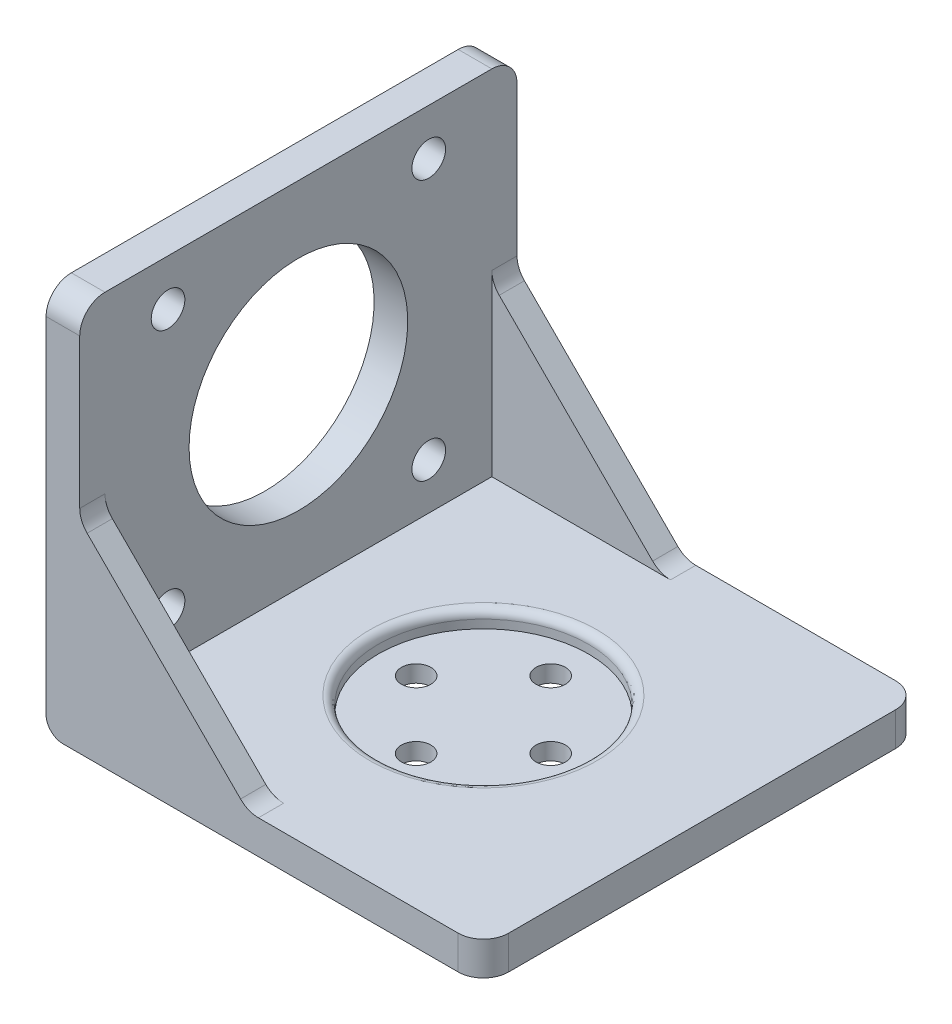
ISO-10303-21;
HEADER;
FILE_DESCRIPTION(('STEP AP214'),'2;1');
FILE_NAME('part.step','',(''),(''),'','','');
FILE_SCHEMA(('AUTOMOTIVE_DESIGN { 1 0 10303 214 1 1 1 1 }'));
ENDSEC;
DATA;
#1=APPLICATION_CONTEXT('core data for automotive mechanical design processes');
#2=APPLICATION_PROTOCOL_DEFINITION('international standard','automotive_design',2000,#1);
#3=PRODUCT_CONTEXT('',#1,'mechanical');
#4=PRODUCT('Part','Part','',(#3));
#5=PRODUCT_RELATED_PRODUCT_CATEGORY('part','',(#4));
#6=PRODUCT_DEFINITION_FORMATION('','',#4);
#7=PRODUCT_DEFINITION_CONTEXT('part definition',#1,'design');
#8=PRODUCT_DEFINITION('design','',#6,#7);
#9=PRODUCT_DEFINITION_SHAPE('','',#8);
#10=(LENGTH_UNIT() NAMED_UNIT(*) SI_UNIT(.MILLI.,.METRE.));
#11=(NAMED_UNIT(*) PLANE_ANGLE_UNIT() SI_UNIT($,.RADIAN.));
#12=(NAMED_UNIT(*) SI_UNIT($,.STERADIAN.) SOLID_ANGLE_UNIT());
#13=UNCERTAINTY_MEASURE_WITH_UNIT(LENGTH_MEASURE(1.E-05),#10,'distance_accuracy_value','');
#14=(GEOMETRIC_REPRESENTATION_CONTEXT(3) GLOBAL_UNCERTAINTY_ASSIGNED_CONTEXT((#13)) GLOBAL_UNIT_ASSIGNED_CONTEXT((#10,
#11,#12)) REPRESENTATION_CONTEXT('',''));
#15=CARTESIAN_POINT('',(0.,0.,0.));
#16=DIRECTION('',(0.,0.,1.));
#17=DIRECTION('',(1.,0.,0.));
#18=AXIS2_PLACEMENT_3D('',#15,#16,#17);
#19=CARTESIAN_POINT('',(8.,4.,0.));
#20=DIRECTION('',(0.,-1.,0.));
#21=DIRECTION('',(0.,0.,-1.));
#22=AXIS2_PLACEMENT_3D('',#19,#20,#21);
#23=CYLINDRICAL_SURFACE('',#22,1.75);
#24=CARTESIAN_POINT('',(8.,0.,0.));
#25=DIRECTION('',(0.,1.,0.));
#26=DIRECTION('',(0.,0.,1.));
#27=AXIS2_PLACEMENT_3D('',#24,#25,#26);
#28=CIRCLE('',#27,1.75);
#29=CARTESIAN_POINT('',(8.,0.,1.75));
#30=VERTEX_POINT('',#29);
#31=EDGE_CURVE('E212',#30,#30,#28,.T.);
#32=ORIENTED_EDGE('',*,*,#31,.F.);
#33=EDGE_LOOP('',(#32));
#34=FACE_BOUND('',#33,.T.);
#35=CARTESIAN_POINT('',(8.,2.,0.));
#36=DIRECTION('',(0.,1.,0.));
#37=DIRECTION('',(0.,0.,1.));
#38=AXIS2_PLACEMENT_3D('',#35,#36,#37);
#39=CIRCLE('',#38,1.75);
#40=CARTESIAN_POINT('',(8.,2.,1.75));
#41=VERTEX_POINT('',#40);
#42=EDGE_CURVE('E344',#41,#41,#39,.T.);
#43=ORIENTED_EDGE('',*,*,#42,.T.);
#44=EDGE_LOOP('',(#43));
#45=FACE_BOUND('',#44,.T.);
#46=ADVANCED_FACE('F39',(#34,#45),#23,.F.);
#47=CARTESIAN_POINT('',(0.,4.,-8.));
#48=DIRECTION('',(0.,-1.,0.));
#49=DIRECTION('',(0.,0.,-1.));
#50=AXIS2_PLACEMENT_3D('',#47,#48,#49);
#51=CYLINDRICAL_SURFACE('',#50,1.75);
#52=CARTESIAN_POINT('',(0.,0.,-8.));
#53=DIRECTION('',(0.,1.,0.));
#54=DIRECTION('',(0.,0.,1.));
#55=AXIS2_PLACEMENT_3D('',#52,#53,#54);
#56=CIRCLE('',#55,1.75);
#57=CARTESIAN_POINT('',(0.,0.,-6.25));
#58=VERTEX_POINT('',#57);
#59=EDGE_CURVE('E209',#58,#58,#56,.T.);
#60=ORIENTED_EDGE('',*,*,#59,.F.);
#61=EDGE_LOOP('',(#60));
#62=FACE_BOUND('',#61,.T.);
#63=CARTESIAN_POINT('',(0.,2.,-8.));
#64=DIRECTION('',(0.,1.,0.));
#65=DIRECTION('',(0.,0.,1.));
#66=AXIS2_PLACEMENT_3D('',#63,#64,#65);
#67=CIRCLE('',#66,1.75);
#68=CARTESIAN_POINT('',(0.,2.,-6.25));
#69=VERTEX_POINT('',#68);
#70=EDGE_CURVE('E341',#69,#69,#67,.T.);
#71=ORIENTED_EDGE('',*,*,#70,.T.);
#72=EDGE_LOOP('',(#71));
#73=FACE_BOUND('',#72,.T.);
#74=ADVANCED_FACE('F455',(#62,#73),#51,.F.);
#75=CARTESIAN_POINT('',(-8.,4.,0.));
#76=DIRECTION('',(0.,-1.,0.));
#77=DIRECTION('',(0.,0.,-1.));
#78=AXIS2_PLACEMENT_3D('',#75,#76,#77);
#79=CYLINDRICAL_SURFACE('',#78,1.75);
#80=CARTESIAN_POINT('',(-8.,0.,0.));
#81=DIRECTION('',(0.,1.,0.));
#82=DIRECTION('',(0.,0.,1.));
#83=AXIS2_PLACEMENT_3D('',#80,#81,#82);
#84=CIRCLE('',#83,1.75);
#85=CARTESIAN_POINT('',(-8.,0.,1.75));
#86=VERTEX_POINT('',#85);
#87=EDGE_CURVE('E199',#86,#86,#84,.T.);
#88=ORIENTED_EDGE('',*,*,#87,.F.);
#89=EDGE_LOOP('',(#88));
#90=FACE_BOUND('',#89,.T.);
#91=CARTESIAN_POINT('',(-8.,2.,0.));
#92=DIRECTION('',(0.,1.,0.));
#93=DIRECTION('',(0.,0.,1.));
#94=AXIS2_PLACEMENT_3D('',#91,#92,#93);
#95=CIRCLE('',#94,1.75);
#96=CARTESIAN_POINT('',(-8.,2.,1.75));
#97=VERTEX_POINT('',#96);
#98=EDGE_CURVE('E225',#97,#97,#95,.T.);
#99=ORIENTED_EDGE('',*,*,#98,.T.);
#100=EDGE_LOOP('',(#99));
#101=FACE_BOUND('',#100,.T.);
#102=ADVANCED_FACE('F461',(#90,#101),#79,.F.);
#103=CARTESIAN_POINT('',(0.,4.,8.));
#104=DIRECTION('',(0.,-1.,0.));
#105=DIRECTION('',(0.,0.,-1.));
#106=AXIS2_PLACEMENT_3D('',#103,#104,#105);
#107=CYLINDRICAL_SURFACE('',#106,1.75);
#108=CARTESIAN_POINT('',(0.,0.,8.));
#109=DIRECTION('',(0.,1.,0.));
#110=DIRECTION('',(0.,0.,1.));
#111=AXIS2_PLACEMENT_3D('',#108,#109,#110);
#112=CIRCLE('',#111,1.75);
#113=CARTESIAN_POINT('',(0.,0.,9.75));
#114=VERTEX_POINT('',#113);
#115=EDGE_CURVE('E196',#114,#114,#112,.T.);
#116=ORIENTED_EDGE('',*,*,#115,.F.);
#117=EDGE_LOOP('',(#116));
#118=FACE_BOUND('',#117,.T.);
#119=CARTESIAN_POINT('',(0.,2.,8.));
#120=DIRECTION('',(0.,1.,0.));
#121=DIRECTION('',(0.,0.,1.));
#122=AXIS2_PLACEMENT_3D('',#119,#120,#121);
#123=CIRCLE('',#122,1.75);
#124=CARTESIAN_POINT('',(0.,2.,9.75));
#125=VERTEX_POINT('',#124);
#126=EDGE_CURVE('E222',#125,#125,#123,.T.);
#127=ORIENTED_EDGE('',*,*,#126,.T.);
#128=EDGE_LOOP('',(#127));
#129=FACE_BOUND('',#128,.T.);
#130=ADVANCED_FACE('F471',(#118,#129),#107,.F.);
#131=CARTESIAN_POINT('',(0.,4.,0.));
#132=DIRECTION('',(0.,-1.,0.));
#133=DIRECTION('',(0.,0.,-1.));
#134=AXIS2_PLACEMENT_3D('',#131,#132,#133);
#135=PLANE('',#134);
#136=CARTESIAN_POINT('',(0.,4.,0.));
#137=DIRECTION('',(0.,-1.,0.));
#138=DIRECTION('',(0.,0.,-1.));
#139=AXIS2_PLACEMENT_3D('',#136,#137,#138);
#140=CIRCLE('',#139,13.5);
#141=CARTESIAN_POINT('',(0.,4.,-13.5));
#142=VERTEX_POINT('',#141);
#143=EDGE_CURVE('E302',#142,#142,#140,.T.);
#144=ORIENTED_EDGE('',*,*,#143,.T.);
#145=EDGE_LOOP('',(#144));
#146=FACE_BOUND('',#145,.T.);
#147=DIRECTION('',(1.,0.,0.));
#148=VECTOR('',#147,1.);
#149=CARTESIAN_POINT('',(26.,4.,-26.));
#150=LINE('',#149,#148);
#151=CARTESIAN_POINT('',(-0.75735931288072,4.,-26.));
#152=VERTEX_POINT('',#151);
#153=CARTESIAN_POINT('',(23.,4.,-26.));
#154=VERTEX_POINT('',#153);
#155=EDGE_CURVE('E421',#152,#154,#150,.T.);
#156=ORIENTED_EDGE('',*,*,#155,.F.);
#157=DIRECTION('',(0.,0.,1.));
#158=VECTOR('',#157,1.);
#159=CARTESIAN_POINT('',(-0.75735931288072,4.,-23.));
#160=LINE('',#159,#158);
#161=CARTESIAN_POINT('',(-0.757359312880727,4.,-23.));
#162=VERTEX_POINT('',#161);
#163=EDGE_CURVE('E189',#152,#162,#160,.T.);
#164=ORIENTED_EDGE('',*,*,#163,.T.);
#165=DIRECTION('',(-1.,0.,0.));
#166=VECTOR('',#165,1.);
#167=CARTESIAN_POINT('',(-26.,4.,-23.));
#168=LINE('',#167,#166);
#169=CARTESIAN_POINT('',(-22.,4.,-23.));
#170=VERTEX_POINT('',#169);
#171=EDGE_CURVE('E173',#162,#170,#168,.T.);
#172=ORIENTED_EDGE('',*,*,#171,.T.);
#173=DIRECTION('',(0.,0.,1.));
#174=VECTOR('',#173,1.);
#175=CARTESIAN_POINT('',(-22.,4.,23.));
#176=LINE('',#175,#174);
#177=CARTESIAN_POINT('',(-22.,4.,23.));
#178=VERTEX_POINT('',#177);
#179=EDGE_CURVE('E179',#170,#178,#176,.T.);
#180=ORIENTED_EDGE('',*,*,#179,.T.);
#181=DIRECTION('',(1.,0.,0.));
#182=VECTOR('',#181,1.);
#183=CARTESIAN_POINT('',(-26.,4.,23.));
#184=LINE('',#183,#182);
#185=CARTESIAN_POINT('',(-0.75735931288072,4.,23.));
#186=VERTEX_POINT('',#185);
#187=EDGE_CURVE('E190',#178,#186,#184,.T.);
#188=ORIENTED_EDGE('',*,*,#187,.T.);
#189=DIRECTION('',(0.,0.,-1.));
#190=VECTOR('',#189,1.);
#191=CARTESIAN_POINT('',(-0.75735931288072,4.,0.));
#192=LINE('',#191,#190);
#193=CARTESIAN_POINT('',(-0.75735931288072,4.,26.));
#194=VERTEX_POINT('',#193);
#195=EDGE_CURVE('E277',#186,#194,#192,.F.);
#196=ORIENTED_EDGE('',*,*,#195,.T.);
#197=DIRECTION('',(1.,0.,0.));
#198=VECTOR('',#197,1.);
#199=CARTESIAN_POINT('',(-2.00000000000001,4.,26.));
#200=LINE('',#199,#198);
#201=CARTESIAN_POINT('',(23.,4.,26.));
#202=VERTEX_POINT('',#201);
#203=EDGE_CURVE('E333',#194,#202,#200,.T.);
#204=ORIENTED_EDGE('',*,*,#203,.T.);
#205=CARTESIAN_POINT('',(23.,4.,23.));
#206=DIRECTION('',(0.,-1.,0.));
#207=DIRECTION('',(0.,0.,-1.));
#208=AXIS2_PLACEMENT_3D('',#205,#206,#207);
#209=CIRCLE('',#208,3.);
#210=CARTESIAN_POINT('',(26.,4.,23.));
#211=VERTEX_POINT('',#210);
#212=EDGE_CURVE('E254',#202,#211,#209,.F.);
#213=ORIENTED_EDGE('',*,*,#212,.T.);
#214=DIRECTION('',(0.,0.,-1.));
#215=VECTOR('',#214,1.);
#216=CARTESIAN_POINT('',(26.,4.,23.));
#217=LINE('',#216,#215);
#218=CARTESIAN_POINT('',(26.,4.,-23.));
#219=VERTEX_POINT('',#218);
#220=EDGE_CURVE('E191',#211,#219,#217,.T.);
#221=ORIENTED_EDGE('',*,*,#220,.T.);
#222=CARTESIAN_POINT('',(23.,4.,-23.));
#223=DIRECTION('',(0.,-1.,0.));
#224=DIRECTION('',(0.,0.,-1.));
#225=AXIS2_PLACEMENT_3D('',#222,#223,#224);
#226=CIRCLE('',#225,3.);
#227=EDGE_CURVE('E263',#219,#154,#226,.F.);
#228=ORIENTED_EDGE('',*,*,#227,.T.);
#229=EDGE_LOOP('',(#156,#164,#172,#180,#188,#196,#204,#213,#221,#228));
#230=FACE_BOUND('',#229,.T.);
#231=ADVANCED_FACE('F186',(#146,#230),#135,.F.);
#232=CARTESIAN_POINT('',(0.,0.,0.));
#233=DIRECTION('',(0.,-1.,0.));
#234=DIRECTION('',(0.,0.,-1.));
#235=AXIS2_PLACEMENT_3D('',#232,#233,#234);
#236=PLANE('',#235);
#237=ORIENTED_EDGE('',*,*,#87,.T.);
#238=EDGE_LOOP('',(#237));
#239=FACE_BOUND('',#238,.T.);
#240=ORIENTED_EDGE('',*,*,#31,.T.);
#241=EDGE_LOOP('',(#240));
#242=FACE_BOUND('',#241,.T.);
#243=DIRECTION('',(-1.,0.,0.));
#244=VECTOR('',#243,1.);
#245=CARTESIAN_POINT('',(26.,0.,26.));
#246=LINE('',#245,#244);
#247=CARTESIAN_POINT('',(23.,0.,26.));
#248=VERTEX_POINT('',#247);
#249=CARTESIAN_POINT('',(-24.,0.,26.));
#250=VERTEX_POINT('',#249);
#251=EDGE_CURVE('E322',#248,#250,#246,.T.);
#252=ORIENTED_EDGE('',*,*,#251,.T.);
#253=DIRECTION('',(0.,0.,1.));
#254=VECTOR('',#253,1.);
#255=CARTESIAN_POINT('',(-24.,0.,-26.));
#256=LINE('',#255,#254);
#257=CARTESIAN_POINT('',(-24.,0.,-26.));
#258=VERTEX_POINT('',#257);
#259=EDGE_CURVE('E47',#250,#258,#256,.F.);
#260=ORIENTED_EDGE('',*,*,#259,.T.);
#261=DIRECTION('',(-1.,0.,0.));
#262=VECTOR('',#261,1.);
#263=CARTESIAN_POINT('',(-26.,0.,-26.));
#264=LINE('',#263,#262);
#265=CARTESIAN_POINT('',(23.,0.,-26.));
#266=VERTEX_POINT('',#265);
#267=EDGE_CURVE('E423',#266,#258,#264,.T.);
#268=ORIENTED_EDGE('',*,*,#267,.F.);
#269=CARTESIAN_POINT('',(23.,0.,-23.));
#270=DIRECTION('',(0.,-1.,0.));
#271=DIRECTION('',(0.,0.,-1.));
#272=AXIS2_PLACEMENT_3D('',#269,#270,#271);
#273=CIRCLE('',#272,3.);
#274=CARTESIAN_POINT('',(26.,0.,-23.));
#275=VERTEX_POINT('',#274);
#276=EDGE_CURVE('E259',#266,#275,#273,.T.);
#277=ORIENTED_EDGE('',*,*,#276,.T.);
#278=DIRECTION('',(0.,0.,-1.));
#279=VECTOR('',#278,1.);
#280=CARTESIAN_POINT('',(26.,0.,23.));
#281=LINE('',#280,#279);
#282=CARTESIAN_POINT('',(26.,0.,23.));
#283=VERTEX_POINT('',#282);
#284=EDGE_CURVE('E215',#283,#275,#281,.T.);
#285=ORIENTED_EDGE('',*,*,#284,.F.);
#286=CARTESIAN_POINT('',(23.,0.,23.));
#287=DIRECTION('',(0.,-1.,0.));
#288=DIRECTION('',(0.,0.,-1.));
#289=AXIS2_PLACEMENT_3D('',#286,#287,#288);
#290=CIRCLE('',#289,3.);
#291=EDGE_CURVE('E249',#283,#248,#290,.T.);
#292=ORIENTED_EDGE('',*,*,#291,.T.);
#293=EDGE_LOOP('',(#252,#260,#268,#277,#285,#292));
#294=FACE_BOUND('',#293,.T.);
#295=ORIENTED_EDGE('',*,*,#59,.T.);
#296=EDGE_LOOP('',(#295));
#297=FACE_BOUND('',#296,.T.);
#298=ORIENTED_EDGE('',*,*,#115,.T.);
#299=EDGE_LOOP('',(#298));
#300=FACE_BOUND('',#299,.T.);
#301=ADVANCED_FACE('F470',(#239,#242,#294,#297,#300),#236,.T.);
#302=CARTESIAN_POINT('',(26.,4.,23.));
#303=DIRECTION('',(-1.,0.,0.));
#304=DIRECTION('',(0.,0.,1.));
#305=AXIS2_PLACEMENT_3D('',#302,#303,#304);
#306=PLANE('',#305);
#307=ORIENTED_EDGE('',*,*,#284,.T.);
#308=DIRECTION('',(0.,-1.,0.));
#309=VECTOR('',#308,1.);
#310=CARTESIAN_POINT('',(26.,4.,-23.));
#311=LINE('',#310,#309);
#312=EDGE_CURVE('E261',#275,#219,#311,.F.);
#313=ORIENTED_EDGE('',*,*,#312,.T.);
#314=ORIENTED_EDGE('',*,*,#220,.F.);
#315=DIRECTION('',(0.,-1.,0.));
#316=VECTOR('',#315,1.);
#317=CARTESIAN_POINT('',(26.,4.,23.));
#318=LINE('',#317,#316);
#319=EDGE_CURVE('E246',#211,#283,#318,.T.);
#320=ORIENTED_EDGE('',*,*,#319,.T.);
#321=EDGE_LOOP('',(#307,#313,#314,#320));
#322=FACE_BOUND('',#321,.T.);
#323=ADVANCED_FACE('F415',(#322),#306,.F.);
#324=CARTESIAN_POINT('',(-26.,4.,23.));
#325=DIRECTION('',(1.,0.,0.));
#326=DIRECTION('',(0.,0.,-1.));
#327=AXIS2_PLACEMENT_3D('',#324,#325,#326);
#328=PLANE('',#327);
#329=DIRECTION('',(0.,1.,0.));
#330=VECTOR('',#329,1.);
#331=CARTESIAN_POINT('',(-26.,46.,-26.));
#332=LINE('',#331,#330);
#333=CARTESIAN_POINT('',(-26.,2.,-26.));
#334=VERTEX_POINT('',#333);
#335=CARTESIAN_POINT('',(-26.,43.,-26.));
#336=VERTEX_POINT('',#335);
#337=EDGE_CURVE('E314',#334,#336,#332,.T.);
#338=ORIENTED_EDGE('',*,*,#337,.F.);
#339=DIRECTION('',(0.,0.,1.));
#340=VECTOR('',#339,1.);
#341=CARTESIAN_POINT('',(-26.,2.,26.));
#342=LINE('',#341,#340);
#343=CARTESIAN_POINT('',(-26.,2.,26.));
#344=VERTEX_POINT('',#343);
#345=EDGE_CURVE('E305',#334,#344,#342,.T.);
#346=ORIENTED_EDGE('',*,*,#345,.T.);
#347=DIRECTION('',(0.,1.,0.));
#348=VECTOR('',#347,1.);
#349=CARTESIAN_POINT('',(-26.,0.,26.));
#350=LINE('',#349,#348);
#351=CARTESIAN_POINT('',(-26.,43.,26.));
#352=VERTEX_POINT('',#351);
#353=EDGE_CURVE('E313',#344,#352,#350,.T.);
#354=ORIENTED_EDGE('',*,*,#353,.T.);
#355=CARTESIAN_POINT('',(-26.,43.,23.));
#356=DIRECTION('',(1.,0.,0.));
#357=DIRECTION('',(0.,0.,-1.));
#358=AXIS2_PLACEMENT_3D('',#355,#356,#357);
#359=CIRCLE('',#358,3.);
#360=CARTESIAN_POINT('',(-26.,46.,23.));
#361=VERTEX_POINT('',#360);
#362=EDGE_CURVE('E234',#352,#361,#359,.F.);
#363=ORIENTED_EDGE('',*,*,#362,.T.);
#364=DIRECTION('',(0.,0.,-1.));
#365=VECTOR('',#364,1.);
#366=CARTESIAN_POINT('',(-26.,46.,23.));
#367=LINE('',#366,#365);
#368=CARTESIAN_POINT('',(-26.,46.,-23.));
#369=VERTEX_POINT('',#368);
#370=EDGE_CURVE('E203',#361,#369,#367,.T.);
#371=ORIENTED_EDGE('',*,*,#370,.T.);
#372=CARTESIAN_POINT('',(-26.,43.,-23.));
#373=DIRECTION('',(1.,0.,0.));
#374=DIRECTION('',(0.,0.,-1.));
#375=AXIS2_PLACEMENT_3D('',#372,#373,#374);
#376=CIRCLE('',#375,3.);
#377=EDGE_CURVE('E243',#369,#336,#376,.F.);
#378=ORIENTED_EDGE('',*,*,#377,.T.);
#379=EDGE_LOOP('',(#338,#346,#354,#363,#371,#378));
#380=FACE_BOUND('',#379,.T.);
#381=CARTESIAN_POINT('',(-26.,25.,0.));
#382=DIRECTION('',(-1.,0.,0.));
#383=DIRECTION('',(0.,0.,1.));
#384=AXIS2_PLACEMENT_3D('',#381,#382,#383);
#385=CIRCLE('',#384,13.);
#386=CARTESIAN_POINT('',(-26.,25.,13.));
#387=VERTEX_POINT('',#386);
#388=EDGE_CURVE('E347',#387,#387,#385,.T.);
#389=ORIENTED_EDGE('',*,*,#388,.F.);
#390=EDGE_LOOP('',(#389));
#391=FACE_BOUND('',#390,.T.);
#392=CARTESIAN_POINT('',(-26.,40.5,-15.5));
#393=DIRECTION('',(-1.,0.,0.));
#394=DIRECTION('',(0.,0.,1.));
#395=AXIS2_PLACEMENT_3D('',#392,#393,#394);
#396=CIRCLE('',#395,2.);
#397=CARTESIAN_POINT('',(-26.,40.5,-13.5));
#398=VERTEX_POINT('',#397);
#399=EDGE_CURVE('E351',#398,#398,#396,.T.);
#400=ORIENTED_EDGE('',*,*,#399,.F.);
#401=EDGE_LOOP('',(#400));
#402=FACE_BOUND('',#401,.T.);
#403=CARTESIAN_POINT('',(-26.,9.5,-15.5));
#404=DIRECTION('',(-1.,0.,0.));
#405=DIRECTION('',(0.,0.,1.));
#406=AXIS2_PLACEMENT_3D('',#403,#404,#405);
#407=CIRCLE('',#406,2.);
#408=CARTESIAN_POINT('',(-26.,9.5,-13.5));
#409=VERTEX_POINT('',#408);
#410=EDGE_CURVE('E357',#409,#409,#407,.T.);
#411=ORIENTED_EDGE('',*,*,#410,.F.);
#412=EDGE_LOOP('',(#411));
#413=FACE_BOUND('',#412,.T.);
#414=CARTESIAN_POINT('',(-26.,9.5,15.5));
#415=DIRECTION('',(-1.,0.,0.));
#416=DIRECTION('',(0.,0.,1.));
#417=AXIS2_PLACEMENT_3D('',#414,#415,#416);
#418=CIRCLE('',#417,2.);
#419=CARTESIAN_POINT('',(-26.,9.5,17.5));
#420=VERTEX_POINT('',#419);
#421=EDGE_CURVE('E363',#420,#420,#418,.T.);
#422=ORIENTED_EDGE('',*,*,#421,.F.);
#423=EDGE_LOOP('',(#422));
#424=FACE_BOUND('',#423,.T.);
#425=CARTESIAN_POINT('',(-26.,40.5,15.5));
#426=DIRECTION('',(-1.,0.,0.));
#427=DIRECTION('',(0.,0.,1.));
#428=AXIS2_PLACEMENT_3D('',#425,#426,#427);
#429=CIRCLE('',#428,2.00000000000001);
#430=CARTESIAN_POINT('',(-26.,40.5,17.5));
#431=VERTEX_POINT('',#430);
#432=EDGE_CURVE('E369',#431,#431,#429,.T.);
#433=ORIENTED_EDGE('',*,*,#432,.F.);
#434=EDGE_LOOP('',(#433));
#435=FACE_BOUND('',#434,.T.);
#436=ADVANCED_FACE('F311',(#380,#391,#402,#413,#424,#435),#328,.F.);
#437=CARTESIAN_POINT('',(-22.,46.,23.));
#438=DIRECTION('',(0.,1.,0.));
#439=DIRECTION('',(0.,0.,1.));
#440=AXIS2_PLACEMENT_3D('',#437,#438,#439);
#441=PLANE('',#440);
#442=DIRECTION('',(0.,0.,-1.));
#443=VECTOR('',#442,1.);
#444=CARTESIAN_POINT('',(-22.,46.,23.));
#445=LINE('',#444,#443);
#446=CARTESIAN_POINT('',(-22.,46.,23.));
#447=VERTEX_POINT('',#446);
#448=CARTESIAN_POINT('',(-22.,46.,-23.));
#449=VERTEX_POINT('',#448);
#450=EDGE_CURVE('E180',#447,#449,#445,.T.);
#451=ORIENTED_EDGE('',*,*,#450,.T.);
#452=DIRECTION('',(1.,0.,0.));
#453=VECTOR('',#452,1.);
#454=CARTESIAN_POINT('',(-26.,46.,-23.));
#455=LINE('',#454,#453);
#456=EDGE_CURVE('E241',#449,#369,#455,.F.);
#457=ORIENTED_EDGE('',*,*,#456,.T.);
#458=ORIENTED_EDGE('',*,*,#370,.F.);
#459=DIRECTION('',(1.,0.,0.));
#460=VECTOR('',#459,1.);
#461=CARTESIAN_POINT('',(-22.,46.,23.));
#462=LINE('',#461,#460);
#463=EDGE_CURVE('E219',#361,#447,#462,.T.);
#464=ORIENTED_EDGE('',*,*,#463,.T.);
#465=EDGE_LOOP('',(#451,#457,#458,#464));
#466=FACE_BOUND('',#465,.T.);
#467=ADVANCED_FACE('F380',(#466),#441,.T.);
#468=CARTESIAN_POINT('',(-22.,0.,0.));
#469=DIRECTION('',(-1.,0.,0.));
#470=DIRECTION('',(0.,0.,1.));
#471=AXIS2_PLACEMENT_3D('',#468,#469,#470);
#472=PLANE('',#471);
#473=CARTESIAN_POINT('',(-22.,25.,0.));
#474=DIRECTION('',(-1.,0.,0.));
#475=DIRECTION('',(0.,0.,1.));
#476=AXIS2_PLACEMENT_3D('',#473,#474,#475);
#477=CIRCLE('',#476,13.);
#478=CARTESIAN_POINT('',(-22.,25.,13.));
#479=VERTEX_POINT('',#478);
#480=EDGE_CURVE('E348',#479,#479,#477,.T.);
#481=ORIENTED_EDGE('',*,*,#480,.T.);
#482=EDGE_LOOP('',(#481));
#483=FACE_BOUND('',#482,.T.);
#484=CARTESIAN_POINT('',(-22.,40.5,-15.5));
#485=DIRECTION('',(-1.,0.,0.));
#486=DIRECTION('',(0.,0.,1.));
#487=AXIS2_PLACEMENT_3D('',#484,#485,#486);
#488=CIRCLE('',#487,2.);
#489=CARTESIAN_POINT('',(-22.,40.5,-13.5));
#490=VERTEX_POINT('',#489);
#491=EDGE_CURVE('E354',#490,#490,#488,.T.);
#492=ORIENTED_EDGE('',*,*,#491,.T.);
#493=EDGE_LOOP('',(#492));
#494=FACE_BOUND('',#493,.T.);
#495=CARTESIAN_POINT('',(-22.,9.5,-15.5));
#496=DIRECTION('',(-1.,0.,0.));
#497=DIRECTION('',(0.,0.,1.));
#498=AXIS2_PLACEMENT_3D('',#495,#496,#497);
#499=CIRCLE('',#498,2.);
#500=CARTESIAN_POINT('',(-22.,9.5,-13.5));
#501=VERTEX_POINT('',#500);
#502=EDGE_CURVE('E360',#501,#501,#499,.T.);
#503=ORIENTED_EDGE('',*,*,#502,.T.);
#504=EDGE_LOOP('',(#503));
#505=FACE_BOUND('',#504,.T.);
#506=CARTESIAN_POINT('',(-22.,9.5,15.5));
#507=DIRECTION('',(-1.,0.,0.));
#508=DIRECTION('',(0.,0.,1.));
#509=AXIS2_PLACEMENT_3D('',#506,#507,#508);
#510=CIRCLE('',#509,2.);
#511=CARTESIAN_POINT('',(-22.,9.5,17.5));
#512=VERTEX_POINT('',#511);
#513=EDGE_CURVE('E366',#512,#512,#510,.T.);
#514=ORIENTED_EDGE('',*,*,#513,.T.);
#515=EDGE_LOOP('',(#514));
#516=FACE_BOUND('',#515,.T.);
#517=CARTESIAN_POINT('',(-22.,40.5,15.5));
#518=DIRECTION('',(-1.,0.,0.));
#519=DIRECTION('',(0.,0.,1.));
#520=AXIS2_PLACEMENT_3D('',#517,#518,#519);
#521=CIRCLE('',#520,2.00000000000001);
#522=CARTESIAN_POINT('',(-22.,40.5,17.5));
#523=VERTEX_POINT('',#522);
#524=EDGE_CURVE('E205',#523,#523,#521,.T.);
#525=ORIENTED_EDGE('',*,*,#524,.T.);
#526=EDGE_LOOP('',(#525));
#527=FACE_BOUND('',#526,.T.);
#528=DIRECTION('',(0.,-1.,0.));
#529=VECTOR('',#528,1.);
#530=CARTESIAN_POINT('',(-22.,4.,-23.));
#531=LINE('',#530,#529);
#532=CARTESIAN_POINT('',(-22.,25.2426406871193,-23.));
#533=VERTEX_POINT('',#532);
#534=EDGE_CURVE('E169',#533,#170,#531,.T.);
#535=ORIENTED_EDGE('',*,*,#534,.F.);
#536=DIRECTION('',(0.,0.,1.));
#537=VECTOR('',#536,1.);
#538=CARTESIAN_POINT('',(-22.,25.2426406871193,-26.));
#539=LINE('',#538,#537);
#540=CARTESIAN_POINT('',(-22.,25.2426406871193,-26.));
#541=VERTEX_POINT('',#540);
#542=EDGE_CURVE('E287',#533,#541,#539,.F.);
#543=ORIENTED_EDGE('',*,*,#542,.T.);
#544=DIRECTION('',(0.,-1.,0.));
#545=VECTOR('',#544,1.);
#546=CARTESIAN_POINT('',(-22.,24.,-26.));
#547=LINE('',#546,#545);
#548=CARTESIAN_POINT('',(-22.,43.,-26.));
#549=VERTEX_POINT('',#548);
#550=EDGE_CURVE('E437',#549,#541,#547,.T.);
#551=ORIENTED_EDGE('',*,*,#550,.F.);
#552=CARTESIAN_POINT('',(-22.,43.,-23.));
#553=DIRECTION('',(-1.,0.,0.));
#554=DIRECTION('',(0.,0.,1.));
#555=AXIS2_PLACEMENT_3D('',#552,#553,#554);
#556=CIRCLE('',#555,3.);
#557=EDGE_CURVE('E239',#549,#449,#556,.F.);
#558=ORIENTED_EDGE('',*,*,#557,.T.);
#559=ORIENTED_EDGE('',*,*,#450,.F.);
#560=CARTESIAN_POINT('',(-22.,43.,23.));
#561=DIRECTION('',(-1.,0.,0.));
#562=DIRECTION('',(0.,0.,1.));
#563=AXIS2_PLACEMENT_3D('',#560,#561,#562);
#564=CIRCLE('',#563,3.);
#565=CARTESIAN_POINT('',(-22.,43.,26.));
#566=VERTEX_POINT('',#565);
#567=EDGE_CURVE('E229',#447,#566,#564,.F.);
#568=ORIENTED_EDGE('',*,*,#567,.T.);
#569=DIRECTION('',(0.,-1.,0.));
#570=VECTOR('',#569,1.);
#571=CARTESIAN_POINT('',(-22.,46.,26.));
#572=LINE('',#571,#570);
#573=CARTESIAN_POINT('',(-22.,25.2426406871193,26.));
#574=VERTEX_POINT('',#573);
#575=EDGE_CURVE('E321',#566,#574,#572,.T.);
#576=ORIENTED_EDGE('',*,*,#575,.T.);
#577=DIRECTION('',(0.,0.,-1.));
#578=VECTOR('',#577,1.);
#579=CARTESIAN_POINT('',(-22.,25.2426406871193,0.));
#580=LINE('',#579,#578);
#581=CARTESIAN_POINT('',(-22.,25.2426406871193,23.));
#582=VERTEX_POINT('',#581);
#583=EDGE_CURVE('E266',#574,#582,#580,.T.);
#584=ORIENTED_EDGE('',*,*,#583,.T.);
#585=DIRECTION('',(0.,1.,0.));
#586=VECTOR('',#585,1.);
#587=CARTESIAN_POINT('',(-22.,4.,23.));
#588=LINE('',#587,#586);
#589=EDGE_CURVE('E195',#178,#582,#588,.T.);
#590=ORIENTED_EDGE('',*,*,#589,.F.);
#591=ORIENTED_EDGE('',*,*,#179,.F.);
#592=EDGE_LOOP('',(#535,#543,#551,#558,#559,#568,#576,#584,#590,#591));
#593=FACE_BOUND('',#592,.T.);
#594=ADVANCED_FACE('F193',(#483,#494,#505,#516,#527,#593),#472,.F.);
#595=CARTESIAN_POINT('',(-22.,40.5,15.5));
#596=DIRECTION('',(-1.,0.,0.));
#597=DIRECTION('',(0.,0.,1.));
#598=AXIS2_PLACEMENT_3D('',#595,#596,#597);
#599=CYLINDRICAL_SURFACE('',#598,2.00000000000001);
#600=ORIENTED_EDGE('',*,*,#524,.F.);
#601=EDGE_LOOP('',(#600));
#602=FACE_BOUND('',#601,.T.);
#603=ORIENTED_EDGE('',*,*,#432,.T.);
#604=EDGE_LOOP('',(#603));
#605=FACE_BOUND('',#604,.T.);
#606=ADVANCED_FACE('F723',(#602,#605),#599,.F.);
#607=CARTESIAN_POINT('',(-22.,9.5,15.5));
#608=DIRECTION('',(-1.,0.,0.));
#609=DIRECTION('',(0.,0.,1.));
#610=AXIS2_PLACEMENT_3D('',#607,#608,#609);
#611=CYLINDRICAL_SURFACE('',#610,2.);
#612=ORIENTED_EDGE('',*,*,#513,.F.);
#613=EDGE_LOOP('',(#612));
#614=FACE_BOUND('',#613,.T.);
#615=ORIENTED_EDGE('',*,*,#421,.T.);
#616=EDGE_LOOP('',(#615));
#617=FACE_BOUND('',#616,.T.);
#618=ADVANCED_FACE('F713',(#614,#617),#611,.F.);
#619=CARTESIAN_POINT('',(-22.,9.5,-15.5));
#620=DIRECTION('',(-1.,0.,0.));
#621=DIRECTION('',(0.,0.,1.));
#622=AXIS2_PLACEMENT_3D('',#619,#620,#621);
#623=CYLINDRICAL_SURFACE('',#622,2.);
#624=ORIENTED_EDGE('',*,*,#502,.F.);
#625=EDGE_LOOP('',(#624));
#626=FACE_BOUND('',#625,.T.);
#627=ORIENTED_EDGE('',*,*,#410,.T.);
#628=EDGE_LOOP('',(#627));
#629=FACE_BOUND('',#628,.T.);
#630=ADVANCED_FACE('F703',(#626,#629),#623,.F.);
#631=CARTESIAN_POINT('',(-22.,40.5,-15.5));
#632=DIRECTION('',(-1.,0.,0.));
#633=DIRECTION('',(0.,0.,1.));
#634=AXIS2_PLACEMENT_3D('',#631,#632,#633);
#635=CYLINDRICAL_SURFACE('',#634,2.);
#636=ORIENTED_EDGE('',*,*,#491,.F.);
#637=EDGE_LOOP('',(#636));
#638=FACE_BOUND('',#637,.T.);
#639=ORIENTED_EDGE('',*,*,#399,.T.);
#640=EDGE_LOOP('',(#639));
#641=FACE_BOUND('',#640,.T.);
#642=ADVANCED_FACE('F694',(#638,#641),#635,.F.);
#643=CARTESIAN_POINT('',(-22.,25.,0.));
#644=DIRECTION('',(-1.,0.,0.));
#645=DIRECTION('',(0.,0.,1.));
#646=AXIS2_PLACEMENT_3D('',#643,#644,#645);
#647=CYLINDRICAL_SURFACE('',#646,13.);
#648=ORIENTED_EDGE('',*,*,#480,.F.);
#649=EDGE_LOOP('',(#648));
#650=FACE_BOUND('',#649,.T.);
#651=ORIENTED_EDGE('',*,*,#388,.T.);
#652=EDGE_LOOP('',(#651));
#653=FACE_BOUND('',#652,.T.);
#654=ADVANCED_FACE('F652',(#650,#653),#647,.F.);
#655=CARTESIAN_POINT('',(0.,2.,0.));
#656=DIRECTION('',(0.,1.,0.));
#657=DIRECTION('',(0.,0.,1.));
#658=AXIS2_PLACEMENT_3D('',#655,#656,#657);
#659=CYLINDRICAL_SURFACE('',#658,12.5);
#660=CARTESIAN_POINT('',(0.,3.,0.));
#661=DIRECTION('',(0.,-1.,0.));
#662=DIRECTION('',(0.,0.,-1.));
#663=AXIS2_PLACEMENT_3D('',#660,#661,#662);
#664=CIRCLE('',#663,12.5);
#665=CARTESIAN_POINT('',(0.,3.,-12.5));
#666=VERTEX_POINT('',#665);
#667=EDGE_CURVE('E299',#666,#666,#664,.F.);
#668=ORIENTED_EDGE('',*,*,#667,.T.);
#669=EDGE_LOOP('',(#668));
#670=FACE_BOUND('',#669,.T.);
#671=CARTESIAN_POINT('',(0.,2.,0.));
#672=DIRECTION('',(0.,1.,0.));
#673=DIRECTION('',(0.,0.,1.));
#674=AXIS2_PLACEMENT_3D('',#671,#672,#673);
#675=CIRCLE('',#674,12.5);
#676=CARTESIAN_POINT('',(0.,2.,12.5));
#677=VERTEX_POINT('',#676);
#678=EDGE_CURVE('E226',#677,#677,#675,.T.);
#679=ORIENTED_EDGE('',*,*,#678,.F.);
#680=EDGE_LOOP('',(#679));
#681=FACE_BOUND('',#680,.T.);
#682=ADVANCED_FACE('F513',(#670,#681),#659,.F.);
#683=CARTESIAN_POINT('',(0.,2.,0.));
#684=DIRECTION('',(0.,1.,0.));
#685=DIRECTION('',(0.,0.,1.));
#686=AXIS2_PLACEMENT_3D('',#683,#684,#685);
#687=PLANE('',#686);
#688=ORIENTED_EDGE('',*,*,#42,.F.);
#689=EDGE_LOOP('',(#688));
#690=FACE_BOUND('',#689,.T.);
#691=ORIENTED_EDGE('',*,*,#70,.F.);
#692=EDGE_LOOP('',(#691));
#693=FACE_BOUND('',#692,.T.);
#694=ORIENTED_EDGE('',*,*,#98,.F.);
#695=EDGE_LOOP('',(#694));
#696=FACE_BOUND('',#695,.T.);
#697=ORIENTED_EDGE('',*,*,#126,.F.);
#698=EDGE_LOOP('',(#697));
#699=FACE_BOUND('',#698,.T.);
#700=ORIENTED_EDGE('',*,*,#678,.T.);
#701=EDGE_LOOP('',(#700));
#702=FACE_BOUND('',#701,.T.);
#703=ADVANCED_FACE('F634',(#690,#693,#696,#699,#702),#687,.T.);
#704=CARTESIAN_POINT('',(0.,0.,23.));
#705=DIRECTION('',(0.,0.,-1.));
#706=DIRECTION('',(-1.,0.,0.));
#707=AXIS2_PLACEMENT_3D('',#704,#705,#706);
#708=PLANE('',#707);
#709=ORIENTED_EDGE('',*,*,#187,.F.);
#710=ORIENTED_EDGE('',*,*,#589,.T.);
#711=CARTESIAN_POINT('',(-19.,25.2426406871193,23.));
#712=DIRECTION('',(0.,0.,-1.));
#713=DIRECTION('',(-1.,0.,0.));
#714=AXIS2_PLACEMENT_3D('',#711,#712,#713);
#715=CIRCLE('',#714,3.);
#716=CARTESIAN_POINT('',(-21.1213203435596,23.1213203435596,23.));
#717=VERTEX_POINT('',#716);
#718=EDGE_CURVE('E270',#582,#717,#715,.F.);
#719=ORIENTED_EDGE('',*,*,#718,.T.);
#720=DIRECTION('',(0.707106781186547,-0.707106781186548,0.));
#721=VECTOR('',#720,1.);
#722=CARTESIAN_POINT('',(-22.,24.,23.));
#723=LINE('',#722,#721);
#724=CARTESIAN_POINT('',(-2.87867965644036,4.87867965644036,23.));
#725=VERTEX_POINT('',#724);
#726=EDGE_CURVE('E327',#717,#725,#723,.T.);
#727=ORIENTED_EDGE('',*,*,#726,.T.);
#728=CARTESIAN_POINT('',(-0.75735931288072,7.,23.));
#729=DIRECTION('',(0.,0.,-1.));
#730=DIRECTION('',(-1.,0.,0.));
#731=AXIS2_PLACEMENT_3D('',#728,#729,#730);
#732=CIRCLE('',#731,3.);
#733=EDGE_CURVE('E279',#725,#186,#732,.F.);
#734=ORIENTED_EDGE('',*,*,#733,.T.);
#735=EDGE_LOOP('',(#709,#710,#719,#727,#734));
#736=FACE_BOUND('',#735,.T.);
#737=ADVANCED_FACE('F398',(#736),#708,.T.);
#738=CARTESIAN_POINT('',(-22.,24.,26.));
#739=DIRECTION('',(0.707106781186548,0.707106781186547,0.));
#740=DIRECTION('',(-0.707106781186547,0.707106781186548,0.));
#741=AXIS2_PLACEMENT_3D('',#738,#739,#740);
#742=PLANE('',#741);
#743=DIRECTION('',(0.707106781186547,-0.707106781186548,0.));
#744=VECTOR('',#743,1.);
#745=CARTESIAN_POINT('',(-22.,24.,26.));
#746=LINE('',#745,#744);
#747=CARTESIAN_POINT('',(-21.1213203435596,23.1213203435596,26.));
#748=VERTEX_POINT('',#747);
#749=CARTESIAN_POINT('',(-2.87867965644036,4.87867965644036,26.));
#750=VERTEX_POINT('',#749);
#751=EDGE_CURVE('E325',#748,#750,#746,.T.);
#752=ORIENTED_EDGE('',*,*,#751,.T.);
#753=DIRECTION('',(0.,0.,-1.));
#754=VECTOR('',#753,1.);
#755=CARTESIAN_POINT('',(-2.87867965644036,4.87867965644036,26.));
#756=LINE('',#755,#754);
#757=EDGE_CURVE('E274',#750,#725,#756,.T.);
#758=ORIENTED_EDGE('',*,*,#757,.T.);
#759=ORIENTED_EDGE('',*,*,#726,.F.);
#760=DIRECTION('',(0.,0.,-1.));
#761=VECTOR('',#760,1.);
#762=CARTESIAN_POINT('',(-21.1213203435596,23.1213203435596,26.));
#763=LINE('',#762,#761);
#764=EDGE_CURVE('E268',#717,#748,#763,.F.);
#765=ORIENTED_EDGE('',*,*,#764,.T.);
#766=EDGE_LOOP('',(#752,#758,#759,#765));
#767=FACE_BOUND('',#766,.T.);
#768=ADVANCED_FACE('F400',(#767),#742,.T.);
#769=CARTESIAN_POINT('',(0.,0.,26.));
#770=DIRECTION('',(0.,0.,-1.));
#771=DIRECTION('',(-1.,0.,0.));
#772=AXIS2_PLACEMENT_3D('',#769,#770,#771);
#773=PLANE('',#772);
#774=ORIENTED_EDGE('',*,*,#353,.F.);
#775=CARTESIAN_POINT('',(-24.,2.,26.));
#776=DIRECTION('',(0.,0.,-1.));
#777=DIRECTION('',(-1.,0.,0.));
#778=AXIS2_PLACEMENT_3D('',#775,#776,#777);
#779=CIRCLE('',#778,2.);
#780=EDGE_CURVE('E61',#344,#250,#779,.F.);
#781=ORIENTED_EDGE('',*,*,#780,.T.);
#782=ORIENTED_EDGE('',*,*,#251,.F.);
#783=DIRECTION('',(0.,-1.,0.));
#784=VECTOR('',#783,1.);
#785=CARTESIAN_POINT('',(23.,0.,26.));
#786=LINE('',#785,#784);
#787=EDGE_CURVE('E251',#248,#202,#786,.F.);
#788=ORIENTED_EDGE('',*,*,#787,.T.);
#789=ORIENTED_EDGE('',*,*,#203,.F.);
#790=CARTESIAN_POINT('',(-0.75735931288072,7.,26.));
#791=DIRECTION('',(0.,0.,-1.));
#792=DIRECTION('',(-1.,0.,0.));
#793=AXIS2_PLACEMENT_3D('',#790,#791,#792);
#794=CIRCLE('',#793,3.);
#795=EDGE_CURVE('E282',#194,#750,#794,.T.);
#796=ORIENTED_EDGE('',*,*,#795,.T.);
#797=ORIENTED_EDGE('',*,*,#751,.F.);
#798=CARTESIAN_POINT('',(-19.,25.2426406871193,26.));
#799=DIRECTION('',(0.,0.,-1.));
#800=DIRECTION('',(-1.,0.,0.));
#801=AXIS2_PLACEMENT_3D('',#798,#799,#800);
#802=CIRCLE('',#801,3.);
#803=EDGE_CURVE('E272',#748,#574,#802,.T.);
#804=ORIENTED_EDGE('',*,*,#803,.T.);
#805=ORIENTED_EDGE('',*,*,#575,.F.);
#806=DIRECTION('',(1.,0.,0.));
#807=VECTOR('',#806,1.);
#808=CARTESIAN_POINT('',(-26.,43.,26.));
#809=LINE('',#808,#807);
#810=EDGE_CURVE('E231',#566,#352,#809,.F.);
#811=ORIENTED_EDGE('',*,*,#810,.T.);
#812=EDGE_LOOP('',(#774,#781,#782,#788,#789,#796,#797,#804,#805,#811));
#813=FACE_BOUND('',#812,.T.);
#814=ADVANCED_FACE('F317',(#813),#773,.F.);
#815=CARTESIAN_POINT('',(-2.00000000000001,4.,-26.));
#816=DIRECTION('',(-0.707106781186548,-0.707106781186547,0.));
#817=DIRECTION('',(0.707106781186547,-0.707106781186548,0.));
#818=AXIS2_PLACEMENT_3D('',#815,#816,#817);
#819=PLANE('',#818);
#820=DIRECTION('',(0.707106781186547,-0.707106781186548,0.));
#821=VECTOR('',#820,1.);
#822=CARTESIAN_POINT('',(-2.00000000000001,4.,-23.));
#823=LINE('',#822,#821);
#824=CARTESIAN_POINT('',(-21.1213203435596,23.1213203435596,-23.));
#825=VERTEX_POINT('',#824);
#826=CARTESIAN_POINT('',(-2.87867965644036,4.87867965644036,-23.));
#827=VERTEX_POINT('',#826);
#828=EDGE_CURVE('E431',#825,#827,#823,.T.);
#829=ORIENTED_EDGE('',*,*,#828,.T.);
#830=DIRECTION('',(0.,0.,1.));
#831=VECTOR('',#830,1.);
#832=CARTESIAN_POINT('',(-2.87867965644036,4.87867965644036,-26.));
#833=LINE('',#832,#831);
#834=CARTESIAN_POINT('',(-2.87867965644036,4.87867965644036,-26.));
#835=VERTEX_POINT('',#834);
#836=EDGE_CURVE('E293',#827,#835,#833,.F.);
#837=ORIENTED_EDGE('',*,*,#836,.T.);
#838=DIRECTION('',(0.707106781186547,-0.707106781186548,0.));
#839=VECTOR('',#838,1.);
#840=CARTESIAN_POINT('',(-2.00000000000001,4.,-26.));
#841=LINE('',#840,#839);
#842=CARTESIAN_POINT('',(-21.1213203435596,23.1213203435596,-26.));
#843=VERTEX_POINT('',#842);
#844=EDGE_CURVE('E424',#843,#835,#841,.T.);
#845=ORIENTED_EDGE('',*,*,#844,.F.);
#846=DIRECTION('',(0.,0.,1.));
#847=VECTOR('',#846,1.);
#848=CARTESIAN_POINT('',(-21.1213203435596,23.1213203435596,-23.));
#849=LINE('',#848,#847);
#850=EDGE_CURVE('E284',#843,#825,#849,.T.);
#851=ORIENTED_EDGE('',*,*,#850,.T.);
#852=EDGE_LOOP('',(#829,#837,#845,#851));
#853=FACE_BOUND('',#852,.T.);
#854=ADVANCED_FACE('F433',(#853),#819,.F.);
#855=CARTESIAN_POINT('',(0.,0.,-26.));
#856=DIRECTION('',(0.,0.,1.));
#857=DIRECTION('',(1.,0.,0.));
#858=AXIS2_PLACEMENT_3D('',#855,#856,#857);
#859=PLANE('',#858);
#860=ORIENTED_EDGE('',*,*,#267,.T.);
#861=CARTESIAN_POINT('',(-24.,2.,-26.));
#862=DIRECTION('',(0.,0.,1.));
#863=DIRECTION('',(1.,0.,0.));
#864=AXIS2_PLACEMENT_3D('',#861,#862,#863);
#865=CIRCLE('',#864,2.);
#866=EDGE_CURVE('E11',#258,#334,#865,.F.);
#867=ORIENTED_EDGE('',*,*,#866,.T.);
#868=ORIENTED_EDGE('',*,*,#337,.T.);
#869=DIRECTION('',(1.,0.,0.));
#870=VECTOR('',#869,1.);
#871=CARTESIAN_POINT('',(-22.,43.,-26.));
#872=LINE('',#871,#870);
#873=EDGE_CURVE('E236',#336,#549,#872,.T.);
#874=ORIENTED_EDGE('',*,*,#873,.T.);
#875=ORIENTED_EDGE('',*,*,#550,.T.);
#876=CARTESIAN_POINT('',(-19.,25.2426406871193,-26.));
#877=DIRECTION('',(0.,0.,1.));
#878=DIRECTION('',(1.,0.,0.));
#879=AXIS2_PLACEMENT_3D('',#876,#877,#878);
#880=CIRCLE('',#879,3.);
#881=EDGE_CURVE('E290',#541,#843,#880,.T.);
#882=ORIENTED_EDGE('',*,*,#881,.T.);
#883=ORIENTED_EDGE('',*,*,#844,.T.);
#884=CARTESIAN_POINT('',(-0.75735931288072,7.,-26.));
#885=DIRECTION('',(0.,0.,1.));
#886=DIRECTION('',(1.,0.,0.));
#887=AXIS2_PLACEMENT_3D('',#884,#885,#886);
#888=CIRCLE('',#887,3.);
#889=EDGE_CURVE('E297',#835,#152,#888,.T.);
#890=ORIENTED_EDGE('',*,*,#889,.T.);
#891=ORIENTED_EDGE('',*,*,#155,.T.);
#892=DIRECTION('',(0.,-1.,0.));
#893=VECTOR('',#892,1.);
#894=CARTESIAN_POINT('',(23.,0.,-26.));
#895=LINE('',#894,#893);
#896=EDGE_CURVE('E256',#154,#266,#895,.T.);
#897=ORIENTED_EDGE('',*,*,#896,.T.);
#898=EDGE_LOOP('',(#860,#867,#868,#874,#875,#882,#883,#890,#891,#897));
#899=FACE_BOUND('',#898,.T.);
#900=ADVANCED_FACE('F443',(#899),#859,.F.);
#901=CARTESIAN_POINT('',(0.,0.,-23.));
#902=DIRECTION('',(0.,0.,1.));
#903=DIRECTION('',(1.,0.,0.));
#904=AXIS2_PLACEMENT_3D('',#901,#902,#903);
#905=PLANE('',#904);
#906=ORIENTED_EDGE('',*,*,#828,.F.);
#907=CARTESIAN_POINT('',(-19.,25.2426406871193,-23.));
#908=DIRECTION('',(0.,0.,1.));
#909=DIRECTION('',(1.,0.,0.));
#910=AXIS2_PLACEMENT_3D('',#907,#908,#909);
#911=CIRCLE('',#910,3.);
#912=EDGE_CURVE('E175',#825,#533,#911,.F.);
#913=ORIENTED_EDGE('',*,*,#912,.T.);
#914=ORIENTED_EDGE('',*,*,#534,.T.);
#915=ORIENTED_EDGE('',*,*,#171,.F.);
#916=CARTESIAN_POINT('',(-0.75735931288072,7.,-23.));
#917=DIRECTION('',(0.,0.,1.));
#918=DIRECTION('',(1.,0.,0.));
#919=AXIS2_PLACEMENT_3D('',#916,#917,#918);
#920=CIRCLE('',#919,3.);
#921=EDGE_CURVE('E295',#162,#827,#920,.F.);
#922=ORIENTED_EDGE('',*,*,#921,.T.);
#923=EDGE_LOOP('',(#906,#913,#914,#915,#922));
#924=FACE_BOUND('',#923,.T.);
#925=ADVANCED_FACE('F172',(#924),#905,.T.);
#926=CARTESIAN_POINT('',(-22.,43.,23.));
#927=DIRECTION('',(-1.,0.,0.));
#928=DIRECTION('',(0.,0.,1.));
#929=AXIS2_PLACEMENT_3D('',#926,#927,#928);
#930=CYLINDRICAL_SURFACE('',#929,3.);
#931=ORIENTED_EDGE('',*,*,#362,.F.);
#932=ORIENTED_EDGE('',*,*,#810,.F.);
#933=ORIENTED_EDGE('',*,*,#567,.F.);
#934=ORIENTED_EDGE('',*,*,#463,.F.);
#935=EDGE_LOOP('',(#931,#932,#933,#934));
#936=FACE_BOUND('',#935,.T.);
#937=ADVANCED_FACE('F388',(#936),#930,.T.);
#938=CARTESIAN_POINT('',(0.,43.,-23.));
#939=DIRECTION('',(-1.,0.,0.));
#940=DIRECTION('',(0.,0.,1.));
#941=AXIS2_PLACEMENT_3D('',#938,#939,#940);
#942=CYLINDRICAL_SURFACE('',#941,3.);
#943=ORIENTED_EDGE('',*,*,#377,.F.);
#944=ORIENTED_EDGE('',*,*,#456,.F.);
#945=ORIENTED_EDGE('',*,*,#557,.F.);
#946=ORIENTED_EDGE('',*,*,#873,.F.);
#947=EDGE_LOOP('',(#943,#944,#945,#946));
#948=FACE_BOUND('',#947,.T.);
#949=ADVANCED_FACE('F385',(#948),#942,.T.);
#950=CARTESIAN_POINT('',(23.,4.,23.));
#951=DIRECTION('',(0.,-1.,0.));
#952=DIRECTION('',(0.,0.,-1.));
#953=AXIS2_PLACEMENT_3D('',#950,#951,#952);
#954=CYLINDRICAL_SURFACE('',#953,3.);
#955=ORIENTED_EDGE('',*,*,#212,.F.);
#956=ORIENTED_EDGE('',*,*,#787,.F.);
#957=ORIENTED_EDGE('',*,*,#291,.F.);
#958=ORIENTED_EDGE('',*,*,#319,.F.);
#959=EDGE_LOOP('',(#955,#956,#957,#958));
#960=FACE_BOUND('',#959,.T.);
#961=ADVANCED_FACE('F411',(#960),#954,.T.);
#962=CARTESIAN_POINT('',(23.,0.,-23.));
#963=DIRECTION('',(0.,-1.,0.));
#964=DIRECTION('',(0.,0.,-1.));
#965=AXIS2_PLACEMENT_3D('',#962,#963,#964);
#966=CYLINDRICAL_SURFACE('',#965,3.);
#967=ORIENTED_EDGE('',*,*,#227,.F.);
#968=ORIENTED_EDGE('',*,*,#312,.F.);
#969=ORIENTED_EDGE('',*,*,#276,.F.);
#970=ORIENTED_EDGE('',*,*,#896,.F.);
#971=EDGE_LOOP('',(#967,#968,#969,#970));
#972=FACE_BOUND('',#971,.T.);
#973=ADVANCED_FACE('F419',(#972),#966,.T.);
#974=CARTESIAN_POINT('',(-19.,25.2426406871193,0.));
#975=DIRECTION('',(0.,0.,-1.));
#976=DIRECTION('',(-1.,0.,0.));
#977=AXIS2_PLACEMENT_3D('',#974,#975,#976);
#978=CYLINDRICAL_SURFACE('',#977,3.);
#979=ORIENTED_EDGE('',*,*,#803,.F.);
#980=ORIENTED_EDGE('',*,*,#764,.F.);
#981=ORIENTED_EDGE('',*,*,#718,.F.);
#982=ORIENTED_EDGE('',*,*,#583,.F.);
#983=EDGE_LOOP('',(#979,#980,#981,#982));
#984=FACE_BOUND('',#983,.T.);
#985=ADVANCED_FACE('F394',(#984),#978,.F.);
#986=CARTESIAN_POINT('',(-0.75735931288072,7.,26.));
#987=DIRECTION('',(0.,0.,-1.));
#988=DIRECTION('',(-1.,0.,0.));
#989=AXIS2_PLACEMENT_3D('',#986,#987,#988);
#990=CYLINDRICAL_SURFACE('',#989,3.);
#991=ORIENTED_EDGE('',*,*,#795,.F.);
#992=ORIENTED_EDGE('',*,*,#195,.F.);
#993=ORIENTED_EDGE('',*,*,#733,.F.);
#994=ORIENTED_EDGE('',*,*,#757,.F.);
#995=EDGE_LOOP('',(#991,#992,#993,#994));
#996=FACE_BOUND('',#995,.T.);
#997=ADVANCED_FACE('F404',(#996),#990,.F.);
#998=CARTESIAN_POINT('',(-19.,25.2426406871193,-26.));
#999=DIRECTION('',(0.,0.,-1.));
#1000=DIRECTION('',(-1.,0.,0.));
#1001=AXIS2_PLACEMENT_3D('',#998,#999,#1000);
#1002=CYLINDRICAL_SURFACE('',#1001,3.);
#1003=ORIENTED_EDGE('',*,*,#881,.F.);
#1004=ORIENTED_EDGE('',*,*,#542,.F.);
#1005=ORIENTED_EDGE('',*,*,#912,.F.);
#1006=ORIENTED_EDGE('',*,*,#850,.F.);
#1007=EDGE_LOOP('',(#1003,#1004,#1005,#1006));
#1008=FACE_BOUND('',#1007,.T.);
#1009=ADVANCED_FACE('F446',(#1008),#1002,.F.);
#1010=CARTESIAN_POINT('',(-0.75735931288072,7.,0.));
#1011=DIRECTION('',(0.,0.,-1.));
#1012=DIRECTION('',(-1.,0.,0.));
#1013=AXIS2_PLACEMENT_3D('',#1010,#1011,#1012);
#1014=CYLINDRICAL_SURFACE('',#1013,3.);
#1015=ORIENTED_EDGE('',*,*,#889,.F.);
#1016=ORIENTED_EDGE('',*,*,#836,.F.);
#1017=ORIENTED_EDGE('',*,*,#921,.F.);
#1018=ORIENTED_EDGE('',*,*,#163,.F.);
#1019=EDGE_LOOP('',(#1015,#1016,#1017,#1018));
#1020=FACE_BOUND('',#1019,.T.);
#1021=ADVANCED_FACE('F428',(#1020),#1014,.F.);
#1022=CARTESIAN_POINT('',(0.,3.,0.));
#1023=DIRECTION('',(0.,-1.,0.));
#1024=DIRECTION('',(0.,0.,-1.));
#1025=AXIS2_PLACEMENT_3D('',#1022,#1023,#1024);
#1026=TOROIDAL_SURFACE('',#1025,13.5,1.);
#1027=ORIENTED_EDGE('',*,*,#143,.F.);
#1028=EDGE_LOOP('',(#1027));
#1029=FACE_BOUND('',#1028,.T.);
#1030=ORIENTED_EDGE('',*,*,#667,.F.);
#1031=EDGE_LOOP('',(#1030));
#1032=FACE_BOUND('',#1031,.T.);
#1033=ADVANCED_FACE('F449',(#1029,#1032),#1026,.T.);
#1034=CARTESIAN_POINT('',(-24.,2.,23.));
#1035=DIRECTION('',(0.,0.,-1.));
#1036=DIRECTION('',(-1.,0.,0.));
#1037=AXIS2_PLACEMENT_3D('',#1034,#1035,#1036);
#1038=CYLINDRICAL_SURFACE('',#1037,2.);
#1039=ORIENTED_EDGE('',*,*,#866,.F.);
#1040=ORIENTED_EDGE('',*,*,#259,.F.);
#1041=ORIENTED_EDGE('',*,*,#780,.F.);
#1042=ORIENTED_EDGE('',*,*,#345,.F.);
#1043=EDGE_LOOP('',(#1039,#1040,#1041,#1042));
#1044=FACE_BOUND('',#1043,.T.);
#1045=ADVANCED_FACE('F41',(#1044),#1038,.T.);
#1046=CLOSED_SHELL('',(#46,#74,#102,#130,#231,#301,#323,#436,#467,#594,#606,#618,#630,#642,#654,
#682,#703,#737,#768,#814,#854,#900,#925,#937,#949,#961,#973,#985,#997,#1009,#1021,#1033,#1045));
#1047=MANIFOLD_SOLID_BREP('B2',#1046);
#1048=ADVANCED_BREP_SHAPE_REPRESENTATION('',(#18,#1047),#14);
#1049=SHAPE_DEFINITION_REPRESENTATION(#9,#1048);
ENDSEC;
END-ISO-10303-21;
